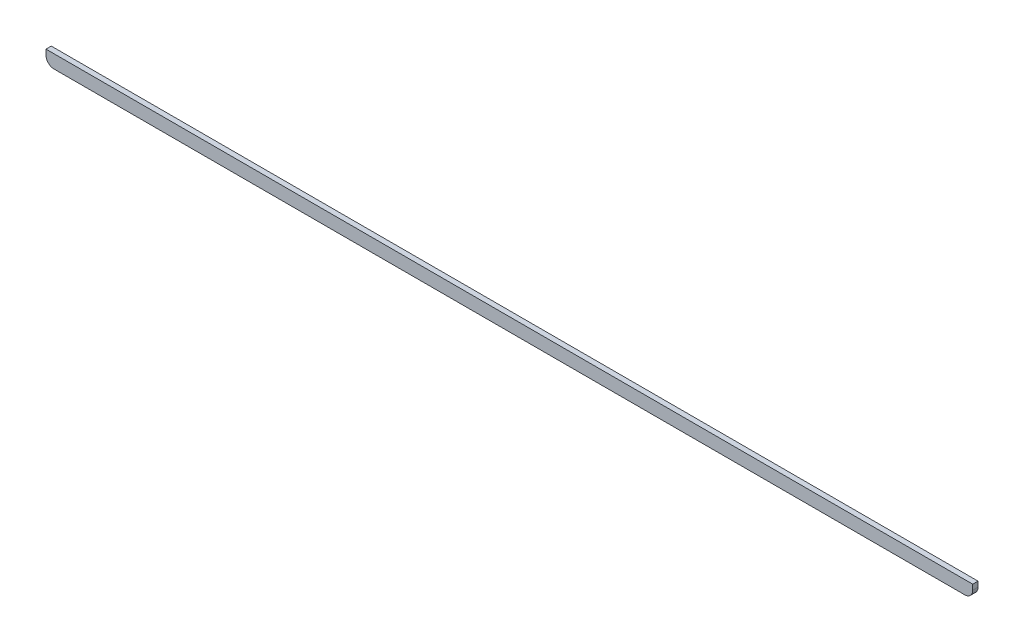
ISO-10303-21;
HEADER;
FILE_DESCRIPTION(('STEP AP214'),'2;1');
FILE_NAME('part.step','',(''),(''),'','','');
FILE_SCHEMA(('AUTOMOTIVE_DESIGN { 1 0 10303 214 1 1 1 1 }'));
ENDSEC;
DATA;
#1=APPLICATION_CONTEXT('core data for automotive mechanical design processes');
#2=APPLICATION_PROTOCOL_DEFINITION('international standard','automotive_design',2000,#1);
#3=PRODUCT_CONTEXT('',#1,'mechanical');
#4=PRODUCT('Part','Part','',(#3));
#5=PRODUCT_RELATED_PRODUCT_CATEGORY('part','',(#4));
#6=PRODUCT_DEFINITION_FORMATION('','',#4);
#7=PRODUCT_DEFINITION_CONTEXT('part definition',#1,'design');
#8=PRODUCT_DEFINITION('design','',#6,#7);
#9=PRODUCT_DEFINITION_SHAPE('','',#8);
#10=(LENGTH_UNIT() NAMED_UNIT(*) SI_UNIT(.MILLI.,.METRE.));
#11=(NAMED_UNIT(*) PLANE_ANGLE_UNIT() SI_UNIT($,.RADIAN.));
#12=(NAMED_UNIT(*) SI_UNIT($,.STERADIAN.) SOLID_ANGLE_UNIT());
#13=UNCERTAINTY_MEASURE_WITH_UNIT(LENGTH_MEASURE(1.E-05),#10,'distance_accuracy_value','');
#14=(GEOMETRIC_REPRESENTATION_CONTEXT(3) GLOBAL_UNCERTAINTY_ASSIGNED_CONTEXT((#13)) GLOBAL_UNIT_ASSIGNED_CONTEXT((#10,
#11,#12)) REPRESENTATION_CONTEXT('',''));
#15=CARTESIAN_POINT('',(0.,0.,0.));
#16=DIRECTION('',(0.,0.,1.));
#17=DIRECTION('',(1.,0.,0.));
#18=AXIS2_PLACEMENT_3D('',#15,#16,#17);
#19=CARTESIAN_POINT('',(-5.,195.5,2.));
#20=DIRECTION('',(1.,0.,0.));
#21=DIRECTION('',(0.,0.,-1.));
#22=AXIS2_PLACEMENT_3D('',#19,#20,#21);
#23=PLANE('',#22);
#24=DIRECTION('',(0.,-1.,0.));
#25=VECTOR('',#24,1.);
#26=CARTESIAN_POINT('',(-5.,195.5,0.));
#27=LINE('',#26,#25);
#28=CARTESIAN_POINT('',(-5.,200.5,0.));
#29=VERTEX_POINT('',#28);
#30=CARTESIAN_POINT('',(-5.,198.5,0.));
#31=VERTEX_POINT('',#30);
#32=EDGE_CURVE('E117',#29,#31,#27,.T.);
#33=ORIENTED_EDGE('',*,*,#32,.T.);
#34=DIRECTION('',(0.,0.,-1.));
#35=VECTOR('',#34,1.);
#36=CARTESIAN_POINT('',(-5.,198.5,2.));
#37=LINE('',#36,#35);
#38=CARTESIAN_POINT('',(-5.,198.5,2.));
#39=VERTEX_POINT('',#38);
#40=EDGE_CURVE('E11',#31,#39,#37,.F.);
#41=ORIENTED_EDGE('',*,*,#40,.T.);
#42=DIRECTION('',(0.,-1.,0.));
#43=VECTOR('',#42,1.);
#44=CARTESIAN_POINT('',(-5.,195.5,2.));
#45=LINE('',#44,#43);
#46=CARTESIAN_POINT('',(-5.,200.5,2.));
#47=VERTEX_POINT('',#46);
#48=EDGE_CURVE('E123',#47,#39,#45,.T.);
#49=ORIENTED_EDGE('',*,*,#48,.F.);
#50=DIRECTION('',(0.,0.,-1.));
#51=VECTOR('',#50,1.);
#52=CARTESIAN_POINT('',(-5.,200.5,2.));
#53=LINE('',#52,#51);
#54=EDGE_CURVE('E109',#47,#29,#53,.T.);
#55=ORIENTED_EDGE('',*,*,#54,.T.);
#56=EDGE_LOOP('',(#33,#41,#49,#55));
#57=FACE_BOUND('',#56,.T.);
#58=ADVANCED_FACE('F35',(#57),#23,.F.);
#59=CARTESIAN_POINT('',(-5.,195.5,2.));
#60=DIRECTION('',(0.,1.,0.));
#61=DIRECTION('',(0.,0.,1.));
#62=AXIS2_PLACEMENT_3D('',#59,#60,#61);
#63=PLANE('',#62);
#64=DIRECTION('',(1.,0.,0.));
#65=VECTOR('',#64,1.);
#66=CARTESIAN_POINT('',(-5.,195.5,0.));
#67=LINE('',#66,#65);
#68=CARTESIAN_POINT('',(-2.,195.5,0.));
#69=VERTEX_POINT('',#68);
#70=CARTESIAN_POINT('',(342.5,195.5,0.));
#71=VERTEX_POINT('',#70);
#72=EDGE_CURVE('E119',#69,#71,#67,.T.);
#73=ORIENTED_EDGE('',*,*,#72,.T.);
#74=DIRECTION('',(0.,0.,-1.));
#75=VECTOR('',#74,1.);
#76=CARTESIAN_POINT('',(342.5,195.5,2.));
#77=LINE('',#76,#75);
#78=CARTESIAN_POINT('',(342.5,195.5,2.));
#79=VERTEX_POINT('',#78);
#80=EDGE_CURVE('E56',#71,#79,#77,.F.);
#81=ORIENTED_EDGE('',*,*,#80,.T.);
#82=DIRECTION('',(1.,0.,0.));
#83=VECTOR('',#82,1.);
#84=CARTESIAN_POINT('',(-5.,195.5,2.));
#85=LINE('',#84,#83);
#86=CARTESIAN_POINT('',(-2.,195.5,2.));
#87=VERTEX_POINT('',#86);
#88=EDGE_CURVE('E99',#87,#79,#85,.T.);
#89=ORIENTED_EDGE('',*,*,#88,.F.);
#90=DIRECTION('',(0.,0.,-1.));
#91=VECTOR('',#90,1.);
#92=CARTESIAN_POINT('',(-2.,195.5,2.));
#93=LINE('',#92,#91);
#94=EDGE_CURVE('E130',#87,#69,#93,.T.);
#95=ORIENTED_EDGE('',*,*,#94,.T.);
#96=EDGE_LOOP('',(#73,#81,#89,#95));
#97=FACE_BOUND('',#96,.T.);
#98=ADVANCED_FACE('F138',(#97),#63,.F.);
#99=CARTESIAN_POINT('',(345.5,195.5,2.));
#100=DIRECTION('',(-1.,0.,0.));
#101=DIRECTION('',(0.,0.,1.));
#102=AXIS2_PLACEMENT_3D('',#99,#100,#101);
#103=PLANE('',#102);
#104=DIRECTION('',(0.,1.,0.));
#105=VECTOR('',#104,1.);
#106=CARTESIAN_POINT('',(345.5,195.5,2.));
#107=LINE('',#106,#105);
#108=CARTESIAN_POINT('',(345.5,198.5,2.));
#109=VERTEX_POINT('',#108);
#110=CARTESIAN_POINT('',(345.5,200.5,2.));
#111=VERTEX_POINT('',#110);
#112=EDGE_CURVE('E89',#109,#111,#107,.T.);
#113=ORIENTED_EDGE('',*,*,#112,.F.);
#114=DIRECTION('',(0.,0.,-1.));
#115=VECTOR('',#114,1.);
#116=CARTESIAN_POINT('',(345.5,198.5,2.));
#117=LINE('',#116,#115);
#118=CARTESIAN_POINT('',(345.5,198.5,0.));
#119=VERTEX_POINT('',#118);
#120=EDGE_CURVE('E108',#109,#119,#117,.T.);
#121=ORIENTED_EDGE('',*,*,#120,.T.);
#122=DIRECTION('',(0.,1.,0.));
#123=VECTOR('',#122,1.);
#124=CARTESIAN_POINT('',(345.5,195.5,0.));
#125=LINE('',#124,#123);
#126=CARTESIAN_POINT('',(345.5,200.5,0.));
#127=VERTEX_POINT('',#126);
#128=EDGE_CURVE('E105',#119,#127,#125,.T.);
#129=ORIENTED_EDGE('',*,*,#128,.T.);
#130=DIRECTION('',(0.,0.,-1.));
#131=VECTOR('',#130,1.);
#132=CARTESIAN_POINT('',(345.5,200.5,2.));
#133=LINE('',#132,#131);
#134=EDGE_CURVE('E102',#111,#127,#133,.T.);
#135=ORIENTED_EDGE('',*,*,#134,.F.);
#136=EDGE_LOOP('',(#113,#121,#129,#135));
#137=FACE_BOUND('',#136,.T.);
#138=ADVANCED_FACE('F103',(#137),#103,.F.);
#139=CARTESIAN_POINT('',(-5.,200.5,2.));
#140=DIRECTION('',(0.,-1.,0.));
#141=DIRECTION('',(0.,0.,-1.));
#142=AXIS2_PLACEMENT_3D('',#139,#140,#141);
#143=PLANE('',#142);
#144=DIRECTION('',(-1.,0.,0.));
#145=VECTOR('',#144,1.);
#146=CARTESIAN_POINT('',(-5.,200.5,0.));
#147=LINE('',#146,#145);
#148=EDGE_CURVE('E122',#127,#29,#147,.T.);
#149=ORIENTED_EDGE('',*,*,#148,.T.);
#150=ORIENTED_EDGE('',*,*,#54,.F.);
#151=DIRECTION('',(-1.,0.,0.));
#152=VECTOR('',#151,1.);
#153=CARTESIAN_POINT('',(-5.,200.5,2.));
#154=LINE('',#153,#152);
#155=EDGE_CURVE('E93',#111,#47,#154,.T.);
#156=ORIENTED_EDGE('',*,*,#155,.F.);
#157=ORIENTED_EDGE('',*,*,#134,.T.);
#158=EDGE_LOOP('',(#149,#150,#156,#157));
#159=FACE_BOUND('',#158,.T.);
#160=ADVANCED_FACE('F111',(#159),#143,.F.);
#161=CARTESIAN_POINT('',(0.,0.,2.));
#162=DIRECTION('',(0.,0.,-1.));
#163=DIRECTION('',(-1.,0.,0.));
#164=AXIS2_PLACEMENT_3D('',#161,#162,#163);
#165=PLANE('',#164);
#166=ORIENTED_EDGE('',*,*,#88,.T.);
#167=CARTESIAN_POINT('',(342.5,198.5,2.));
#168=DIRECTION('',(0.,0.,-1.));
#169=DIRECTION('',(-1.,0.,0.));
#170=AXIS2_PLACEMENT_3D('',#167,#168,#169);
#171=CIRCLE('',#170,3.);
#172=EDGE_CURVE('E43',#79,#109,#171,.F.);
#173=ORIENTED_EDGE('',*,*,#172,.T.);
#174=ORIENTED_EDGE('',*,*,#112,.T.);
#175=ORIENTED_EDGE('',*,*,#155,.T.);
#176=ORIENTED_EDGE('',*,*,#48,.T.);
#177=CARTESIAN_POINT('',(-2.,198.5,2.));
#178=DIRECTION('',(0.,0.,-1.));
#179=DIRECTION('',(-1.,0.,0.));
#180=AXIS2_PLACEMENT_3D('',#177,#178,#179);
#181=CIRCLE('',#180,3.);
#182=EDGE_CURVE('E134',#39,#87,#181,.F.);
#183=ORIENTED_EDGE('',*,*,#182,.T.);
#184=EDGE_LOOP('',(#166,#173,#174,#175,#176,#183));
#185=FACE_BOUND('',#184,.T.);
#186=ADVANCED_FACE('F91',(#185),#165,.F.);
#187=CARTESIAN_POINT('',(0.,0.,0.));
#188=DIRECTION('',(0.,0.,-1.));
#189=DIRECTION('',(-1.,0.,0.));
#190=AXIS2_PLACEMENT_3D('',#187,#188,#189);
#191=PLANE('',#190);
#192=ORIENTED_EDGE('',*,*,#128,.F.);
#193=CARTESIAN_POINT('',(342.5,198.5,0.));
#194=DIRECTION('',(0.,0.,-1.));
#195=DIRECTION('',(-1.,0.,0.));
#196=AXIS2_PLACEMENT_3D('',#193,#194,#195);
#197=CIRCLE('',#196,3.);
#198=EDGE_CURVE('E128',#119,#71,#197,.T.);
#199=ORIENTED_EDGE('',*,*,#198,.T.);
#200=ORIENTED_EDGE('',*,*,#72,.F.);
#201=CARTESIAN_POINT('',(-2.,198.5,0.));
#202=DIRECTION('',(0.,0.,-1.));
#203=DIRECTION('',(-1.,0.,0.));
#204=AXIS2_PLACEMENT_3D('',#201,#202,#203);
#205=CIRCLE('',#204,3.);
#206=EDGE_CURVE('E126',#69,#31,#205,.T.);
#207=ORIENTED_EDGE('',*,*,#206,.T.);
#208=ORIENTED_EDGE('',*,*,#32,.F.);
#209=ORIENTED_EDGE('',*,*,#148,.F.);
#210=EDGE_LOOP('',(#192,#199,#200,#207,#208,#209));
#211=FACE_BOUND('',#210,.T.);
#212=ADVANCED_FACE('F142',(#211),#191,.T.);
#213=CARTESIAN_POINT('',(342.5,198.5,2.));
#214=DIRECTION('',(0.,0.,-1.));
#215=DIRECTION('',(-1.,0.,0.));
#216=AXIS2_PLACEMENT_3D('',#213,#214,#215);
#217=CYLINDRICAL_SURFACE('',#216,3.);
#218=ORIENTED_EDGE('',*,*,#172,.F.);
#219=ORIENTED_EDGE('',*,*,#80,.F.);
#220=ORIENTED_EDGE('',*,*,#198,.F.);
#221=ORIENTED_EDGE('',*,*,#120,.F.);
#222=EDGE_LOOP('',(#218,#219,#220,#221));
#223=FACE_BOUND('',#222,.T.);
#224=ADVANCED_FACE('F151',(#223),#217,.T.);
#225=CARTESIAN_POINT('',(-2.,198.5,2.));
#226=DIRECTION('',(0.,0.,-1.));
#227=DIRECTION('',(-1.,0.,0.));
#228=AXIS2_PLACEMENT_3D('',#225,#226,#227);
#229=CYLINDRICAL_SURFACE('',#228,3.);
#230=ORIENTED_EDGE('',*,*,#182,.F.);
#231=ORIENTED_EDGE('',*,*,#40,.F.);
#232=ORIENTED_EDGE('',*,*,#206,.F.);
#233=ORIENTED_EDGE('',*,*,#94,.F.);
#234=EDGE_LOOP('',(#230,#231,#232,#233));
#235=FACE_BOUND('',#234,.T.);
#236=ADVANCED_FACE('F37',(#235),#229,.T.);
#237=CLOSED_SHELL('',(#58,#98,#138,#160,#186,#212,#224,#236));
#238=MANIFOLD_SOLID_BREP('B2',#237);
#239=ADVANCED_BREP_SHAPE_REPRESENTATION('',(#18,#238),#14);
#240=SHAPE_DEFINITION_REPRESENTATION(#9,#239);
ENDSEC;
END-ISO-10303-21;
